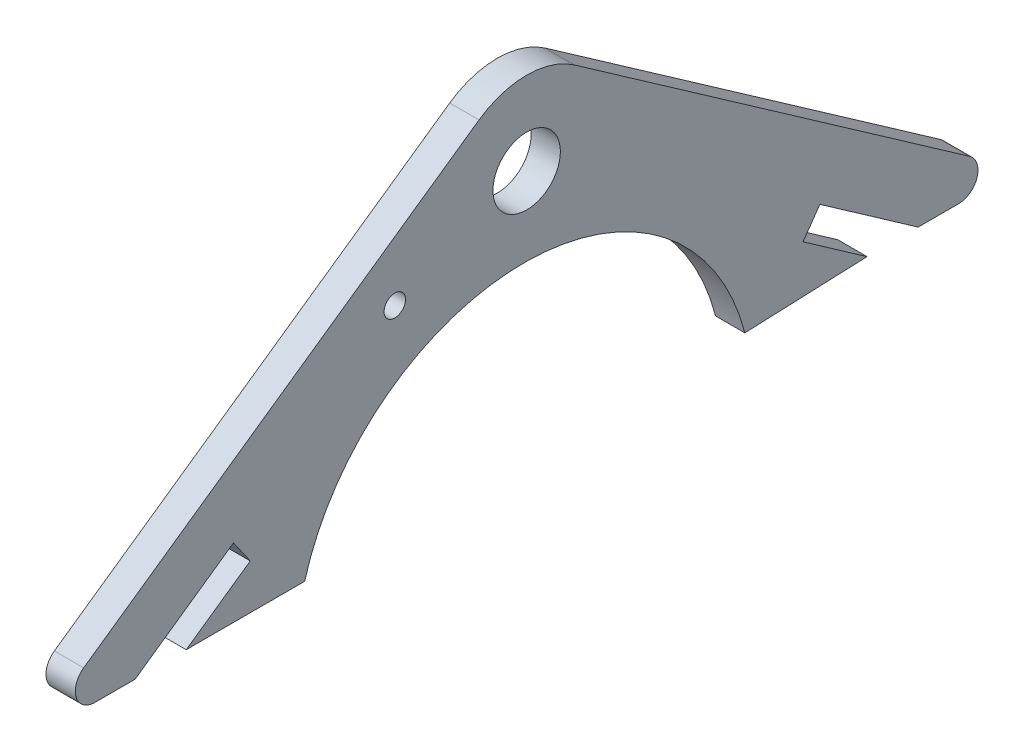
ISO-10303-21;
HEADER;
FILE_DESCRIPTION(('STEP AP214'),'2;1');
FILE_NAME('part.step','',(''),(''),'','','');
FILE_SCHEMA(('AUTOMOTIVE_DESIGN { 1 0 10303 214 1 1 1 1 }'));
ENDSEC;
DATA;
#1=APPLICATION_CONTEXT('core data for automotive mechanical design processes');
#2=APPLICATION_PROTOCOL_DEFINITION('international standard','automotive_design',2000,#1);
#3=PRODUCT_CONTEXT('',#1,'mechanical');
#4=PRODUCT('Part','Part','',(#3));
#5=PRODUCT_RELATED_PRODUCT_CATEGORY('part','',(#4));
#6=PRODUCT_DEFINITION_FORMATION('','',#4);
#7=PRODUCT_DEFINITION_CONTEXT('part definition',#1,'design');
#8=PRODUCT_DEFINITION('design','',#6,#7);
#9=PRODUCT_DEFINITION_SHAPE('','',#8);
#10=(LENGTH_UNIT() NAMED_UNIT(*) SI_UNIT(.MILLI.,.METRE.));
#11=(NAMED_UNIT(*) PLANE_ANGLE_UNIT() SI_UNIT($,.RADIAN.));
#12=(NAMED_UNIT(*) SI_UNIT($,.STERADIAN.) SOLID_ANGLE_UNIT());
#13=UNCERTAINTY_MEASURE_WITH_UNIT(LENGTH_MEASURE(1.E-05),#10,'distance_accuracy_value','');
#14=(GEOMETRIC_REPRESENTATION_CONTEXT(3) GLOBAL_UNCERTAINTY_ASSIGNED_CONTEXT((#13)) GLOBAL_UNIT_ASSIGNED_CONTEXT((#10,
#11,#12)) REPRESENTATION_CONTEXT('',''));
#15=CARTESIAN_POINT('',(0.,0.,0.));
#16=DIRECTION('',(0.,0.,1.));
#17=DIRECTION('',(1.,0.,0.));
#18=AXIS2_PLACEMENT_3D('',#15,#16,#17);
#19=CARTESIAN_POINT('',(3.,-23.,44.1798083266057));
#20=DIRECTION('',(1.,0.,0.));
#21=DIRECTION('',(0.,0.,-1.));
#22=AXIS2_PLACEMENT_3D('',#19,#20,#21);
#23=PLANE('',#22);
#24=CARTESIAN_POINT('',(3.,0.,0.));
#25=DIRECTION('',(1.,0.,0.));
#26=DIRECTION('',(0.,0.,-1.));
#27=AXIS2_PLACEMENT_3D('',#24,#25,#26);
#28=CIRCLE('',#27,3.45);
#29=CARTESIAN_POINT('',(3.,0.,-3.45));
#30=VERTEX_POINT('',#29);
#31=EDGE_CURVE('E182',#30,#30,#28,.T.);
#32=ORIENTED_EDGE('',*,*,#31,.F.);
#33=EDGE_LOOP('',(#32));
#34=FACE_BOUND('',#33,.T.);
#35=DIRECTION('',(0.,0.,-1.));
#36=VECTOR('',#35,1.);
#37=CARTESIAN_POINT('',(3.,-25.,40.0623171576055));
#38=LINE('',#37,#36);
#39=CARTESIAN_POINT('',(3.,-25.,44.1798083266057));
#40=VERTEX_POINT('',#39);
#41=CARTESIAN_POINT('',(3.,-25.,40.0623171576055));
#42=VERTEX_POINT('',#41);
#43=EDGE_CURVE('E209',#40,#42,#38,.T.);
#44=ORIENTED_EDGE('',*,*,#43,.T.);
#45=DIRECTION('',(0.,0.573576436351047,-0.819152044288991));
#46=VECTOR('',#45,1.);
#47=CARTESIAN_POINT('',(3.,-25.,40.0623171576055));
#48=LINE('',#47,#46);
#49=CARTESIAN_POINT('',(3.,-17.9539323763247,29.9994897254834));
#50=VERTEX_POINT('',#49);
#51=EDGE_CURVE('E117',#42,#50,#48,.T.);
#52=ORIENTED_EDGE('',*,*,#51,.T.);
#53=DIRECTION('',(0.,-0.819152044288991,-0.573576436351047));
#54=VECTOR('',#53,1.);
#55=CARTESIAN_POINT('',(3.,-17.9539323763247,29.9994897254834));
#56=LINE('',#55,#54);
#57=CARTESIAN_POINT('',(3.,-20.4113885091916,28.2787604164303));
#58=VERTEX_POINT('',#57);
#59=EDGE_CURVE('E248',#50,#58,#56,.T.);
#60=ORIENTED_EDGE('',*,*,#59,.T.);
#61=DIRECTION('',(0.,-0.573576436351047,0.819152044288991));
#62=VECTOR('',#61,1.);
#63=CARTESIAN_POINT('',(3.,-25.,34.8319767707422));
#64=LINE('',#63,#62);
#65=CARTESIAN_POINT('',(3.,-25.,34.8319767707422));
#66=VERTEX_POINT('',#65);
#67=EDGE_CURVE('E267',#58,#66,#64,.T.);
#68=ORIENTED_EDGE('',*,*,#67,.T.);
#69=DIRECTION('',(0.,0.,-1.));
#70=VECTOR('',#69,1.);
#71=CARTESIAN_POINT('',(3.,-25.,22.7120200430352));
#72=LINE('',#71,#70);
#73=CARTESIAN_POINT('',(3.,-25.,22.7120200430352));
#74=VERTEX_POINT('',#73);
#75=EDGE_CURVE('E264',#66,#74,#72,.T.);
#76=ORIENTED_EDGE('',*,*,#75,.T.);
#77=CARTESIAN_POINT('',(3.,-31.3218757660447,0.261801424249791));
#78=DIRECTION('',(-1.,0.,0.));
#79=DIRECTION('',(0.,0.,1.));
#80=AXIS2_PLACEMENT_3D('',#77,#78,#79);
#81=CIRCLE('',#80,23.3233451552851);
#82=CARTESIAN_POINT('',(3.,-25.505562721812,-22.324675321893));
#83=VERTEX_POINT('',#82);
#84=EDGE_CURVE('E266',#74,#83,#81,.T.);
#85=ORIENTED_EDGE('',*,*,#84,.T.);
#86=DIRECTION('',(0.,0.0403884252997928,-0.999184054667509));
#87=VECTOR('',#86,1.);
#88=CARTESIAN_POINT('',(3.,-25.505562721812,-22.324675321893));
#89=LINE('',#88,#87);
#90=CARTESIAN_POINT('',(3.,-25.,-34.8319767707422));
#91=VERTEX_POINT('',#90);
#92=EDGE_CURVE('E269',#83,#91,#89,.T.);
#93=ORIENTED_EDGE('',*,*,#92,.T.);
#94=DIRECTION('',(0.,0.573576436351048,0.819152044288991));
#95=VECTOR('',#94,1.);
#96=CARTESIAN_POINT('',(3.,-25.,-34.8319767707422));
#97=LINE('',#96,#95);
#98=CARTESIAN_POINT('',(3.,-20.4113885091916,-28.2787604164303));
#99=VERTEX_POINT('',#98);
#100=EDGE_CURVE('E275',#91,#99,#97,.T.);
#101=ORIENTED_EDGE('',*,*,#100,.T.);
#102=DIRECTION('',(0.,0.819152044288994,-0.573576436351043));
#103=VECTOR('',#102,1.);
#104=CARTESIAN_POINT('',(3.,-17.9539323763247,-29.9994897254834));
#105=LINE('',#104,#103);
#106=CARTESIAN_POINT('',(3.,-17.9539323763247,-29.9994897254834));
#107=VERTEX_POINT('',#106);
#108=EDGE_CURVE('E277',#99,#107,#105,.T.);
#109=ORIENTED_EDGE('',*,*,#108,.T.);
#110=DIRECTION('',(0.,-0.573576436351047,-0.819152044288991));
#111=VECTOR('',#110,1.);
#112=CARTESIAN_POINT('',(3.,-25.,-40.0623171576055));
#113=LINE('',#112,#111);
#114=CARTESIAN_POINT('',(3.,-25.,-40.0623171576055));
#115=VERTEX_POINT('',#114);
#116=EDGE_CURVE('E279',#107,#115,#113,.T.);
#117=ORIENTED_EDGE('',*,*,#116,.T.);
#118=DIRECTION('',(0.,0.,-1.));
#119=VECTOR('',#118,1.);
#120=CARTESIAN_POINT('',(3.,-25.,-40.0623171576055));
#121=LINE('',#120,#119);
#122=CARTESIAN_POINT('',(3.,-25.,-44.1798083266057));
#123=VERTEX_POINT('',#122);
#124=EDGE_CURVE('E281',#115,#123,#121,.T.);
#125=ORIENTED_EDGE('',*,*,#124,.T.);
#126=CARTESIAN_POINT('',(3.,-23.,-44.1798083266057));
#127=DIRECTION('',(1.,0.,0.));
#128=DIRECTION('',(0.,0.,1.));
#129=AXIS2_PLACEMENT_3D('',#126,#127,#128);
#130=CIRCLE('',#129,1.99999999999999);
#131=CARTESIAN_POINT('',(3.,-21.361695911422,-45.3269611993078));
#132=VERTEX_POINT('',#131);
#133=EDGE_CURVE('E283',#123,#132,#130,.T.);
#134=ORIENTED_EDGE('',*,*,#133,.T.);
#135=DIRECTION('',(0.,0.573576436351047,0.819152044288991));
#136=VECTOR('',#135,1.);
#137=CARTESIAN_POINT('',(3.,6.96279237645643,-4.8753997089839));
#138=LINE('',#137,#136);
#139=CARTESIAN_POINT('',(3.,6.96279237645643,-4.8753997089839));
#140=VERTEX_POINT('',#139);
#141=EDGE_CURVE('E160',#132,#140,#138,.T.);
#142=ORIENTED_EDGE('',*,*,#141,.T.);
#143=CARTESIAN_POINT('',(3.,0.,0.));
#144=DIRECTION('',(1.,0.,0.));
#145=DIRECTION('',(0.,0.,-1.));
#146=AXIS2_PLACEMENT_3D('',#143,#144,#145);
#147=CIRCLE('',#146,8.5);
#148=CARTESIAN_POINT('',(3.,6.96279237645642,4.8753997089839));
#149=VERTEX_POINT('',#148);
#150=EDGE_CURVE('E154',#140,#149,#147,.T.);
#151=ORIENTED_EDGE('',*,*,#150,.T.);
#152=DIRECTION('',(0.,-0.573576436351047,0.819152044288991));
#153=VECTOR('',#152,1.);
#154=CARTESIAN_POINT('',(3.,6.96279237645642,4.8753997089839));
#155=LINE('',#154,#153);
#156=CARTESIAN_POINT('',(3.,-21.361695911422,45.3269611993078));
#157=VERTEX_POINT('',#156);
#158=EDGE_CURVE('E158',#149,#157,#155,.T.);
#159=ORIENTED_EDGE('',*,*,#158,.T.);
#160=CARTESIAN_POINT('',(3.,-23.,44.1798083266057));
#161=DIRECTION('',(1.,0.,0.));
#162=DIRECTION('',(0.,0.,-1.));
#163=AXIS2_PLACEMENT_3D('',#160,#161,#162);
#164=CIRCLE('',#163,1.99999999999999);
#165=EDGE_CURVE('E50',#157,#40,#164,.T.);
#166=ORIENTED_EDGE('',*,*,#165,.T.);
#167=EDGE_LOOP('',(#44,#52,#60,#68,#76,#85,#93,#101,#109,#117,#125,#134,#142,#151,#159,#166));
#168=FACE_BOUND('',#167,.T.);
#169=CARTESIAN_POINT('',(3.,-5.17434788136854,13.4917983976406));
#170=DIRECTION('',(1.,0.,0.));
#171=DIRECTION('',(0.,0.,-1.));
#172=AXIS2_PLACEMENT_3D('',#169,#170,#171);
#173=CIRCLE('',#172,1.1);
#174=CARTESIAN_POINT('',(3.,-5.17434788136854,12.3917983976406));
#175=VERTEX_POINT('',#174);
#176=EDGE_CURVE('E325',#175,#175,#173,.T.);
#177=ORIENTED_EDGE('',*,*,#176,.F.);
#178=EDGE_LOOP('',(#177));
#179=FACE_BOUND('',#178,.T.);
#180=ADVANCED_FACE('F33',(#34,#168,#179),#23,.T.);
#181=CARTESIAN_POINT('',(0.,-23.,44.1798083266057));
#182=DIRECTION('',(1.,0.,0.));
#183=DIRECTION('',(0.,0.,-1.));
#184=AXIS2_PLACEMENT_3D('',#181,#182,#183);
#185=PLANE('',#184);
#186=DIRECTION('',(0.,0.,-1.));
#187=VECTOR('',#186,1.);
#188=CARTESIAN_POINT('',(0.,-25.,40.0623171576055));
#189=LINE('',#188,#187);
#190=CARTESIAN_POINT('',(0.,-25.,44.1798083266057));
#191=VERTEX_POINT('',#190);
#192=CARTESIAN_POINT('',(0.,-25.,40.0623171576055));
#193=VERTEX_POINT('',#192);
#194=EDGE_CURVE('E178',#191,#193,#189,.T.);
#195=ORIENTED_EDGE('',*,*,#194,.F.);
#196=CARTESIAN_POINT('',(0.,-23.,44.1798083266057));
#197=DIRECTION('',(1.,0.,0.));
#198=DIRECTION('',(0.,0.,-1.));
#199=AXIS2_PLACEMENT_3D('',#196,#197,#198);
#200=CIRCLE('',#199,1.99999999999999);
#201=CARTESIAN_POINT('',(0.,-21.361695911422,45.3269611993078));
#202=VERTEX_POINT('',#201);
#203=EDGE_CURVE('E109',#202,#191,#200,.T.);
#204=ORIENTED_EDGE('',*,*,#203,.F.);
#205=DIRECTION('',(0.,-0.573576436351047,0.819152044288991));
#206=VECTOR('',#205,1.);
#207=CARTESIAN_POINT('',(0.,6.96279237645642,4.8753997089839));
#208=LINE('',#207,#206);
#209=CARTESIAN_POINT('',(0.,6.96279237645642,4.8753997089839));
#210=VERTEX_POINT('',#209);
#211=EDGE_CURVE('E103',#210,#202,#208,.T.);
#212=ORIENTED_EDGE('',*,*,#211,.F.);
#213=CARTESIAN_POINT('',(0.,0.,0.));
#214=DIRECTION('',(1.,0.,0.));
#215=DIRECTION('',(0.,0.,-1.));
#216=AXIS2_PLACEMENT_3D('',#213,#214,#215);
#217=CIRCLE('',#216,8.5);
#218=CARTESIAN_POINT('',(0.,6.96279237645643,-4.8753997089839));
#219=VERTEX_POINT('',#218);
#220=EDGE_CURVE('E168',#219,#210,#217,.T.);
#221=ORIENTED_EDGE('',*,*,#220,.F.);
#222=DIRECTION('',(0.,0.573576436351047,0.819152044288991));
#223=VECTOR('',#222,1.);
#224=CARTESIAN_POINT('',(0.,6.96279237645643,-4.8753997089839));
#225=LINE('',#224,#223);
#226=CARTESIAN_POINT('',(0.,-21.361695911422,-45.3269611993078));
#227=VERTEX_POINT('',#226);
#228=EDGE_CURVE('E204',#227,#219,#225,.T.);
#229=ORIENTED_EDGE('',*,*,#228,.F.);
#230=CARTESIAN_POINT('',(0.,-23.,-44.1798083266057));
#231=DIRECTION('',(1.,0.,0.));
#232=DIRECTION('',(0.,0.,1.));
#233=AXIS2_PLACEMENT_3D('',#230,#231,#232);
#234=CIRCLE('',#233,1.99999999999999);
#235=CARTESIAN_POINT('',(0.,-25.,-44.1798083266057));
#236=VERTEX_POINT('',#235);
#237=EDGE_CURVE('E202',#236,#227,#234,.T.);
#238=ORIENTED_EDGE('',*,*,#237,.F.);
#239=DIRECTION('',(0.,0.,-1.));
#240=VECTOR('',#239,1.);
#241=CARTESIAN_POINT('',(0.,-25.,-40.0623171576055));
#242=LINE('',#241,#240);
#243=CARTESIAN_POINT('',(0.,-25.,-40.0623171576055));
#244=VERTEX_POINT('',#243);
#245=EDGE_CURVE('E200',#244,#236,#242,.T.);
#246=ORIENTED_EDGE('',*,*,#245,.F.);
#247=DIRECTION('',(0.,-0.573576436351047,-0.819152044288991));
#248=VECTOR('',#247,1.);
#249=CARTESIAN_POINT('',(0.,-25.,-40.0623171576055));
#250=LINE('',#249,#248);
#251=CARTESIAN_POINT('',(0.,-17.9539323763247,-29.9994897254834));
#252=VERTEX_POINT('',#251);
#253=EDGE_CURVE('E198',#252,#244,#250,.T.);
#254=ORIENTED_EDGE('',*,*,#253,.F.);
#255=DIRECTION('',(0.,0.819152044288994,-0.573576436351043));
#256=VECTOR('',#255,1.);
#257=CARTESIAN_POINT('',(0.,-17.9539323763247,-29.9994897254834));
#258=LINE('',#257,#256);
#259=CARTESIAN_POINT('',(0.,-20.4113885091916,-28.2787604164303));
#260=VERTEX_POINT('',#259);
#261=EDGE_CURVE('E196',#260,#252,#258,.T.);
#262=ORIENTED_EDGE('',*,*,#261,.F.);
#263=DIRECTION('',(0.,0.573576436351048,0.819152044288991));
#264=VECTOR('',#263,1.);
#265=CARTESIAN_POINT('',(0.,-25.,-34.8319767707422));
#266=LINE('',#265,#264);
#267=CARTESIAN_POINT('',(0.,-25.,-34.8319767707422));
#268=VERTEX_POINT('',#267);
#269=EDGE_CURVE('E194',#268,#260,#266,.T.);
#270=ORIENTED_EDGE('',*,*,#269,.F.);
#271=DIRECTION('',(0.,0.0403884252997928,-0.999184054667509));
#272=VECTOR('',#271,1.);
#273=CARTESIAN_POINT('',(0.,-25.505562721812,-22.324675321893));
#274=LINE('',#273,#272);
#275=CARTESIAN_POINT('',(0.,-25.505562721812,-22.324675321893));
#276=VERTEX_POINT('',#275);
#277=EDGE_CURVE('E192',#276,#268,#274,.T.);
#278=ORIENTED_EDGE('',*,*,#277,.F.);
#279=CARTESIAN_POINT('',(0.,-31.3218757660447,0.261801424249791));
#280=DIRECTION('',(-1.,0.,0.));
#281=DIRECTION('',(0.,0.,1.));
#282=AXIS2_PLACEMENT_3D('',#279,#280,#281);
#283=CIRCLE('',#282,23.3233451552851);
#284=CARTESIAN_POINT('',(0.,-25.,22.7120200430352));
#285=VERTEX_POINT('',#284);
#286=EDGE_CURVE('E190',#285,#276,#283,.T.);
#287=ORIENTED_EDGE('',*,*,#286,.F.);
#288=DIRECTION('',(0.,0.,-1.));
#289=VECTOR('',#288,1.);
#290=CARTESIAN_POINT('',(0.,-25.,22.7120200430352));
#291=LINE('',#290,#289);
#292=CARTESIAN_POINT('',(0.,-25.,34.8319767707422));
#293=VERTEX_POINT('',#292);
#294=EDGE_CURVE('E188',#293,#285,#291,.T.);
#295=ORIENTED_EDGE('',*,*,#294,.F.);
#296=DIRECTION('',(0.,-0.573576436351047,0.819152044288991));
#297=VECTOR('',#296,1.);
#298=CARTESIAN_POINT('',(0.,-25.,34.8319767707422));
#299=LINE('',#298,#297);
#300=CARTESIAN_POINT('',(0.,-20.4113885091916,28.2787604164303));
#301=VERTEX_POINT('',#300);
#302=EDGE_CURVE('E186',#301,#293,#299,.T.);
#303=ORIENTED_EDGE('',*,*,#302,.F.);
#304=DIRECTION('',(0.,-0.819152044288991,-0.573576436351047));
#305=VECTOR('',#304,1.);
#306=CARTESIAN_POINT('',(0.,-17.9539323763247,29.9994897254834));
#307=LINE('',#306,#305);
#308=CARTESIAN_POINT('',(0.,-17.9539323763247,29.9994897254834));
#309=VERTEX_POINT('',#308);
#310=EDGE_CURVE('E184',#309,#301,#307,.T.);
#311=ORIENTED_EDGE('',*,*,#310,.F.);
#312=DIRECTION('',(0.,0.573576436351047,-0.819152044288991));
#313=VECTOR('',#312,1.);
#314=CARTESIAN_POINT('',(0.,-25.,40.0623171576055));
#315=LINE('',#314,#313);
#316=EDGE_CURVE('E181',#193,#309,#315,.T.);
#317=ORIENTED_EDGE('',*,*,#316,.F.);
#318=EDGE_LOOP('',(#195,#204,#212,#221,#229,#238,#246,#254,#262,#270,#278,#287,#295,#303,#311,#317));
#319=FACE_BOUND('',#318,.T.);
#320=CARTESIAN_POINT('',(0.,0.,0.));
#321=DIRECTION('',(1.,0.,0.));
#322=DIRECTION('',(0.,0.,-1.));
#323=AXIS2_PLACEMENT_3D('',#320,#321,#322);
#324=CIRCLE('',#323,3.45);
#325=CARTESIAN_POINT('',(0.,0.,-3.45));
#326=VERTEX_POINT('',#325);
#327=EDGE_CURVE('E331',#326,#326,#324,.T.);
#328=ORIENTED_EDGE('',*,*,#327,.T.);
#329=EDGE_LOOP('',(#328));
#330=FACE_BOUND('',#329,.T.);
#331=CARTESIAN_POINT('',(0.,-5.17434788136854,13.4917983976406));
#332=DIRECTION('',(1.,0.,0.));
#333=DIRECTION('',(0.,0.,-1.));
#334=AXIS2_PLACEMENT_3D('',#331,#332,#333);
#335=CIRCLE('',#334,1.1);
#336=CARTESIAN_POINT('',(0.,-5.17434788136854,12.3917983976406));
#337=VERTEX_POINT('',#336);
#338=EDGE_CURVE('E328',#337,#337,#335,.T.);
#339=ORIENTED_EDGE('',*,*,#338,.T.);
#340=EDGE_LOOP('',(#339));
#341=FACE_BOUND('',#340,.T.);
#342=ADVANCED_FACE('F252',(#319,#330,#341),#185,.F.);
#343=CARTESIAN_POINT('',(3.,-25.,40.0623171576055));
#344=DIRECTION('',(0.,1.,0.));
#345=DIRECTION('',(0.,0.,1.));
#346=AXIS2_PLACEMENT_3D('',#343,#344,#345);
#347=PLANE('',#346);
#348=ORIENTED_EDGE('',*,*,#194,.T.);
#349=DIRECTION('',(-1.,0.,0.));
#350=VECTOR('',#349,1.);
#351=CARTESIAN_POINT('',(3.,-25.,40.0623171576055));
#352=LINE('',#351,#350);
#353=EDGE_CURVE('E11',#42,#193,#352,.T.);
#354=ORIENTED_EDGE('',*,*,#353,.F.);
#355=ORIENTED_EDGE('',*,*,#43,.F.);
#356=DIRECTION('',(-1.,0.,0.));
#357=VECTOR('',#356,1.);
#358=CARTESIAN_POINT('',(3.,-25.,44.1798083266057));
#359=LINE('',#358,#357);
#360=EDGE_CURVE('E174',#40,#191,#359,.T.);
#361=ORIENTED_EDGE('',*,*,#360,.T.);
#362=EDGE_LOOP('',(#348,#354,#355,#361));
#363=FACE_BOUND('',#362,.T.);
#364=ADVANCED_FACE('F35',(#363),#347,.F.);
#365=CARTESIAN_POINT('',(3.,-25.,40.0623171576055));
#366=DIRECTION('',(0.,0.819152044288991,0.573576436351047));
#367=DIRECTION('',(0.,-0.573576436351047,0.819152044288991));
#368=AXIS2_PLACEMENT_3D('',#365,#366,#367);
#369=PLANE('',#368);
#370=ORIENTED_EDGE('',*,*,#316,.T.);
#371=DIRECTION('',(-1.,0.,0.));
#372=VECTOR('',#371,1.);
#373=CARTESIAN_POINT('',(3.,-17.9539323763247,29.9994897254834));
#374=LINE('',#373,#372);
#375=EDGE_CURVE('E42',#50,#309,#374,.T.);
#376=ORIENTED_EDGE('',*,*,#375,.F.);
#377=ORIENTED_EDGE('',*,*,#51,.F.);
#378=ORIENTED_EDGE('',*,*,#353,.T.);
#379=EDGE_LOOP('',(#370,#376,#377,#378));
#380=FACE_BOUND('',#379,.T.);
#381=ADVANCED_FACE('F464',(#380),#369,.F.);
#382=CARTESIAN_POINT('',(3.,-17.9539323763247,29.9994897254834));
#383=DIRECTION('',(0.,0.573576436351047,-0.819152044288991));
#384=DIRECTION('',(0.,0.819152044288992,0.573576436351047));
#385=AXIS2_PLACEMENT_3D('',#382,#383,#384);
#386=PLANE('',#385);
#387=ORIENTED_EDGE('',*,*,#310,.T.);
#388=DIRECTION('',(-1.,0.,0.));
#389=VECTOR('',#388,1.);
#390=CARTESIAN_POINT('',(3.,-20.4113885091916,28.2787604164303));
#391=LINE('',#390,#389);
#392=EDGE_CURVE('E240',#58,#301,#391,.T.);
#393=ORIENTED_EDGE('',*,*,#392,.F.);
#394=ORIENTED_EDGE('',*,*,#59,.F.);
#395=ORIENTED_EDGE('',*,*,#375,.T.);
#396=EDGE_LOOP('',(#387,#393,#394,#395));
#397=FACE_BOUND('',#396,.T.);
#398=ADVANCED_FACE('F246',(#397),#386,.F.);
#399=CARTESIAN_POINT('',(3.,-25.,34.8319767707422));
#400=DIRECTION('',(0.,-0.819152044288991,-0.573576436351047));
#401=DIRECTION('',(0.,0.573576436351047,-0.819152044288991));
#402=AXIS2_PLACEMENT_3D('',#399,#400,#401);
#403=PLANE('',#402);
#404=ORIENTED_EDGE('',*,*,#302,.T.);
#405=DIRECTION('',(-1.,0.,0.));
#406=VECTOR('',#405,1.);
#407=CARTESIAN_POINT('',(3.,-25.,34.8319767707422));
#408=LINE('',#407,#406);
#409=EDGE_CURVE('E237',#66,#293,#408,.T.);
#410=ORIENTED_EDGE('',*,*,#409,.F.);
#411=ORIENTED_EDGE('',*,*,#67,.F.);
#412=ORIENTED_EDGE('',*,*,#392,.T.);
#413=EDGE_LOOP('',(#404,#410,#411,#412));
#414=FACE_BOUND('',#413,.T.);
#415=ADVANCED_FACE('F258',(#414),#403,.F.);
#416=CARTESIAN_POINT('',(3.,-25.,22.7120200430352));
#417=DIRECTION('',(0.,1.,0.));
#418=DIRECTION('',(0.,0.,1.));
#419=AXIS2_PLACEMENT_3D('',#416,#417,#418);
#420=PLANE('',#419);
#421=ORIENTED_EDGE('',*,*,#294,.T.);
#422=DIRECTION('',(-1.,0.,0.));
#423=VECTOR('',#422,1.);
#424=CARTESIAN_POINT('',(3.,-25.,22.7120200430352));
#425=LINE('',#424,#423);
#426=EDGE_CURVE('E234',#74,#285,#425,.T.);
#427=ORIENTED_EDGE('',*,*,#426,.F.);
#428=ORIENTED_EDGE('',*,*,#75,.F.);
#429=ORIENTED_EDGE('',*,*,#409,.T.);
#430=EDGE_LOOP('',(#421,#427,#428,#429));
#431=FACE_BOUND('',#430,.T.);
#432=ADVANCED_FACE('F262',(#431),#420,.F.);
#433=CARTESIAN_POINT('',(3.,-31.3218757660447,0.261801424249791));
#434=DIRECTION('',(-1.,0.,0.));
#435=DIRECTION('',(0.,0.,1.));
#436=AXIS2_PLACEMENT_3D('',#433,#434,#435);
#437=CYLINDRICAL_SURFACE('',#436,23.3233451552851);
#438=ORIENTED_EDGE('',*,*,#286,.T.);
#439=DIRECTION('',(-1.,0.,0.));
#440=VECTOR('',#439,1.);
#441=CARTESIAN_POINT('',(3.,-25.505562721812,-22.324675321893));
#442=LINE('',#441,#440);
#443=EDGE_CURVE('E231',#83,#276,#442,.T.);
#444=ORIENTED_EDGE('',*,*,#443,.F.);
#445=ORIENTED_EDGE('',*,*,#84,.F.);
#446=ORIENTED_EDGE('',*,*,#426,.T.);
#447=EDGE_LOOP('',(#438,#444,#445,#446));
#448=FACE_BOUND('',#447,.T.);
#449=ADVANCED_FACE('F429',(#448),#437,.F.);
#450=CARTESIAN_POINT('',(3.,-25.505562721812,-22.324675321893));
#451=DIRECTION('',(0.,0.999184054667509,0.0403884252997928));
#452=DIRECTION('',(0.,-0.0403884252997928,0.999184054667509));
#453=AXIS2_PLACEMENT_3D('',#450,#451,#452);
#454=PLANE('',#453);
#455=ORIENTED_EDGE('',*,*,#277,.T.);
#456=DIRECTION('',(-1.,0.,0.));
#457=VECTOR('',#456,1.);
#458=CARTESIAN_POINT('',(3.,-25.,-34.8319767707422));
#459=LINE('',#458,#457);
#460=EDGE_CURVE('E228',#91,#268,#459,.T.);
#461=ORIENTED_EDGE('',*,*,#460,.F.);
#462=ORIENTED_EDGE('',*,*,#92,.F.);
#463=ORIENTED_EDGE('',*,*,#443,.T.);
#464=EDGE_LOOP('',(#455,#461,#462,#463));
#465=FACE_BOUND('',#464,.T.);
#466=ADVANCED_FACE('F419',(#465),#454,.F.);
#467=CARTESIAN_POINT('',(3.,-25.,-34.8319767707422));
#468=DIRECTION('',(0.,-0.819152044288991,0.573576436351048));
#469=DIRECTION('',(0.,-0.573576436351048,-0.819152044288991));
#470=AXIS2_PLACEMENT_3D('',#467,#468,#469);
#471=PLANE('',#470);
#472=ORIENTED_EDGE('',*,*,#269,.T.);
#473=DIRECTION('',(-1.,0.,0.));
#474=VECTOR('',#473,1.);
#475=CARTESIAN_POINT('',(3.,-20.4113885091916,-28.2787604164303));
#476=LINE('',#475,#474);
#477=EDGE_CURVE('E225',#99,#260,#476,.T.);
#478=ORIENTED_EDGE('',*,*,#477,.F.);
#479=ORIENTED_EDGE('',*,*,#100,.F.);
#480=ORIENTED_EDGE('',*,*,#460,.T.);
#481=EDGE_LOOP('',(#472,#478,#479,#480));
#482=FACE_BOUND('',#481,.T.);
#483=ADVANCED_FACE('F409',(#482),#471,.F.);
#484=CARTESIAN_POINT('',(3.,-17.9539323763247,-29.9994897254834));
#485=DIRECTION('',(0.,0.573576436351043,0.819152044288994));
#486=DIRECTION('',(0.,-0.819152044288994,0.573576436351043));
#487=AXIS2_PLACEMENT_3D('',#484,#485,#486);
#488=PLANE('',#487);
#489=ORIENTED_EDGE('',*,*,#261,.T.);
#490=DIRECTION('',(-1.,0.,0.));
#491=VECTOR('',#490,1.);
#492=CARTESIAN_POINT('',(3.,-17.9539323763247,-29.9994897254834));
#493=LINE('',#492,#491);
#494=EDGE_CURVE('E222',#107,#252,#493,.T.);
#495=ORIENTED_EDGE('',*,*,#494,.F.);
#496=ORIENTED_EDGE('',*,*,#108,.F.);
#497=ORIENTED_EDGE('',*,*,#477,.T.);
#498=EDGE_LOOP('',(#489,#495,#496,#497));
#499=FACE_BOUND('',#498,.T.);
#500=ADVANCED_FACE('F399',(#499),#488,.F.);
#501=CARTESIAN_POINT('',(3.,-25.,-40.0623171576055));
#502=DIRECTION('',(0.,0.819152044288991,-0.573576436351047));
#503=DIRECTION('',(0.,0.573576436351047,0.819152044288991));
#504=AXIS2_PLACEMENT_3D('',#501,#502,#503);
#505=PLANE('',#504);
#506=ORIENTED_EDGE('',*,*,#253,.T.);
#507=DIRECTION('',(-1.,0.,0.));
#508=VECTOR('',#507,1.);
#509=CARTESIAN_POINT('',(3.,-25.,-40.0623171576055));
#510=LINE('',#509,#508);
#511=EDGE_CURVE('E219',#115,#244,#510,.T.);
#512=ORIENTED_EDGE('',*,*,#511,.F.);
#513=ORIENTED_EDGE('',*,*,#116,.F.);
#514=ORIENTED_EDGE('',*,*,#494,.T.);
#515=EDGE_LOOP('',(#506,#512,#513,#514));
#516=FACE_BOUND('',#515,.T.);
#517=ADVANCED_FACE('F389',(#516),#505,.F.);
#518=CARTESIAN_POINT('',(3.,-25.,-40.0623171576055));
#519=DIRECTION('',(0.,1.,0.));
#520=DIRECTION('',(0.,0.,1.));
#521=AXIS2_PLACEMENT_3D('',#518,#519,#520);
#522=PLANE('',#521);
#523=ORIENTED_EDGE('',*,*,#245,.T.);
#524=DIRECTION('',(-1.,0.,0.));
#525=VECTOR('',#524,1.);
#526=CARTESIAN_POINT('',(3.,-25.,-44.1798083266057));
#527=LINE('',#526,#525);
#528=EDGE_CURVE('E216',#123,#236,#527,.T.);
#529=ORIENTED_EDGE('',*,*,#528,.F.);
#530=ORIENTED_EDGE('',*,*,#124,.F.);
#531=ORIENTED_EDGE('',*,*,#511,.T.);
#532=EDGE_LOOP('',(#523,#529,#530,#531));
#533=FACE_BOUND('',#532,.T.);
#534=ADVANCED_FACE('F380',(#533),#522,.F.);
#535=CARTESIAN_POINT('',(3.,-23.,-44.1798083266057));
#536=DIRECTION('',(-1.,0.,0.));
#537=DIRECTION('',(0.,0.,1.));
#538=AXIS2_PLACEMENT_3D('',#535,#536,#537);
#539=CYLINDRICAL_SURFACE('',#538,1.99999999999999);
#540=ORIENTED_EDGE('',*,*,#237,.T.);
#541=DIRECTION('',(-1.,0.,0.));
#542=VECTOR('',#541,1.);
#543=CARTESIAN_POINT('',(3.,-21.361695911422,-45.3269611993078));
#544=LINE('',#543,#542);
#545=EDGE_CURVE('E213',#132,#227,#544,.T.);
#546=ORIENTED_EDGE('',*,*,#545,.F.);
#547=ORIENTED_EDGE('',*,*,#133,.F.);
#548=ORIENTED_EDGE('',*,*,#528,.T.);
#549=EDGE_LOOP('',(#540,#546,#547,#548));
#550=FACE_BOUND('',#549,.T.);
#551=ADVANCED_FACE('F289',(#550),#539,.T.);
#552=CARTESIAN_POINT('',(3.,6.96279237645643,-4.8753997089839));
#553=DIRECTION('',(0.,-0.819152044288991,0.573576436351047));
#554=DIRECTION('',(0.,-0.573576436351047,-0.819152044288991));
#555=AXIS2_PLACEMENT_3D('',#552,#553,#554);
#556=PLANE('',#555);
#557=ORIENTED_EDGE('',*,*,#228,.T.);
#558=DIRECTION('',(-1.,0.,0.));
#559=VECTOR('',#558,1.);
#560=CARTESIAN_POINT('',(3.,6.96279237645643,-4.8753997089839));
#561=LINE('',#560,#559);
#562=EDGE_CURVE('E169',#140,#219,#561,.T.);
#563=ORIENTED_EDGE('',*,*,#562,.F.);
#564=ORIENTED_EDGE('',*,*,#141,.F.);
#565=ORIENTED_EDGE('',*,*,#545,.T.);
#566=EDGE_LOOP('',(#557,#563,#564,#565));
#567=FACE_BOUND('',#566,.T.);
#568=ADVANCED_FACE('F293',(#567),#556,.F.);
#569=CARTESIAN_POINT('',(3.,0.,0.));
#570=DIRECTION('',(-1.,0.,0.));
#571=DIRECTION('',(0.,0.,1.));
#572=AXIS2_PLACEMENT_3D('',#569,#570,#571);
#573=CYLINDRICAL_SURFACE('',#572,8.5);
#574=ORIENTED_EDGE('',*,*,#220,.T.);
#575=DIRECTION('',(-1.,0.,0.));
#576=VECTOR('',#575,1.);
#577=CARTESIAN_POINT('',(3.,6.96279237645642,4.8753997089839));
#578=LINE('',#577,#576);
#579=EDGE_CURVE('E165',#149,#210,#578,.T.);
#580=ORIENTED_EDGE('',*,*,#579,.F.);
#581=ORIENTED_EDGE('',*,*,#150,.F.);
#582=ORIENTED_EDGE('',*,*,#562,.T.);
#583=EDGE_LOOP('',(#574,#580,#581,#582));
#584=FACE_BOUND('',#583,.T.);
#585=ADVANCED_FACE('F166',(#584),#573,.T.);
#586=CARTESIAN_POINT('',(3.,6.96279237645642,4.8753997089839));
#587=DIRECTION('',(0.,-0.819152044288991,-0.573576436351047));
#588=DIRECTION('',(0.,0.573576436351047,-0.819152044288991));
#589=AXIS2_PLACEMENT_3D('',#586,#587,#588);
#590=PLANE('',#589);
#591=ORIENTED_EDGE('',*,*,#211,.T.);
#592=DIRECTION('',(-1.,0.,0.));
#593=VECTOR('',#592,1.);
#594=CARTESIAN_POINT('',(3.,-21.361695911422,45.3269611993078));
#595=LINE('',#594,#593);
#596=EDGE_CURVE('E170',#157,#202,#595,.T.);
#597=ORIENTED_EDGE('',*,*,#596,.F.);
#598=ORIENTED_EDGE('',*,*,#158,.F.);
#599=ORIENTED_EDGE('',*,*,#579,.T.);
#600=EDGE_LOOP('',(#591,#597,#598,#599));
#601=FACE_BOUND('',#600,.T.);
#602=ADVANCED_FACE('F172',(#601),#590,.F.);
#603=CARTESIAN_POINT('',(3.,-23.,44.1798083266057));
#604=DIRECTION('',(-1.,0.,0.));
#605=DIRECTION('',(0.,0.,1.));
#606=AXIS2_PLACEMENT_3D('',#603,#604,#605);
#607=CYLINDRICAL_SURFACE('',#606,1.99999999999999);
#608=ORIENTED_EDGE('',*,*,#203,.T.);
#609=ORIENTED_EDGE('',*,*,#360,.F.);
#610=ORIENTED_EDGE('',*,*,#165,.F.);
#611=ORIENTED_EDGE('',*,*,#596,.T.);
#612=EDGE_LOOP('',(#608,#609,#610,#611));
#613=FACE_BOUND('',#612,.T.);
#614=ADVANCED_FACE('F297',(#613),#607,.T.);
#615=CARTESIAN_POINT('',(3.,0.,0.));
#616=DIRECTION('',(-1.,0.,0.));
#617=DIRECTION('',(0.,0.,1.));
#618=AXIS2_PLACEMENT_3D('',#615,#616,#617);
#619=CYLINDRICAL_SURFACE('',#618,3.45);
#620=ORIENTED_EDGE('',*,*,#31,.T.);
#621=EDGE_LOOP('',(#620));
#622=FACE_BOUND('',#621,.T.);
#623=ORIENTED_EDGE('',*,*,#327,.F.);
#624=EDGE_LOOP('',(#623));
#625=FACE_BOUND('',#624,.T.);
#626=ADVANCED_FACE('F299',(#622,#625),#619,.F.);
#627=CARTESIAN_POINT('',(3.,-5.17434788136854,13.4917983976406));
#628=DIRECTION('',(-1.,0.,0.));
#629=DIRECTION('',(0.,0.,1.));
#630=AXIS2_PLACEMENT_3D('',#627,#628,#629);
#631=CYLINDRICAL_SURFACE('',#630,1.1);
#632=ORIENTED_EDGE('',*,*,#176,.T.);
#633=EDGE_LOOP('',(#632));
#634=FACE_BOUND('',#633,.T.);
#635=ORIENTED_EDGE('',*,*,#338,.F.);
#636=EDGE_LOOP('',(#635));
#637=FACE_BOUND('',#636,.T.);
#638=ADVANCED_FACE('F305',(#634,#637),#631,.F.);
#639=CLOSED_SHELL('',(#180,#342,#364,#381,#398,#415,#432,#449,#466,#483,#500,#517,#534,#551,
#568,#585,#602,#614,#626,#638));
#640=MANIFOLD_SOLID_BREP('B2',#639);
#641=ADVANCED_BREP_SHAPE_REPRESENTATION('',(#18,#640),#14);
#642=SHAPE_DEFINITION_REPRESENTATION(#9,#641);
ENDSEC;
END-ISO-10303-21;
